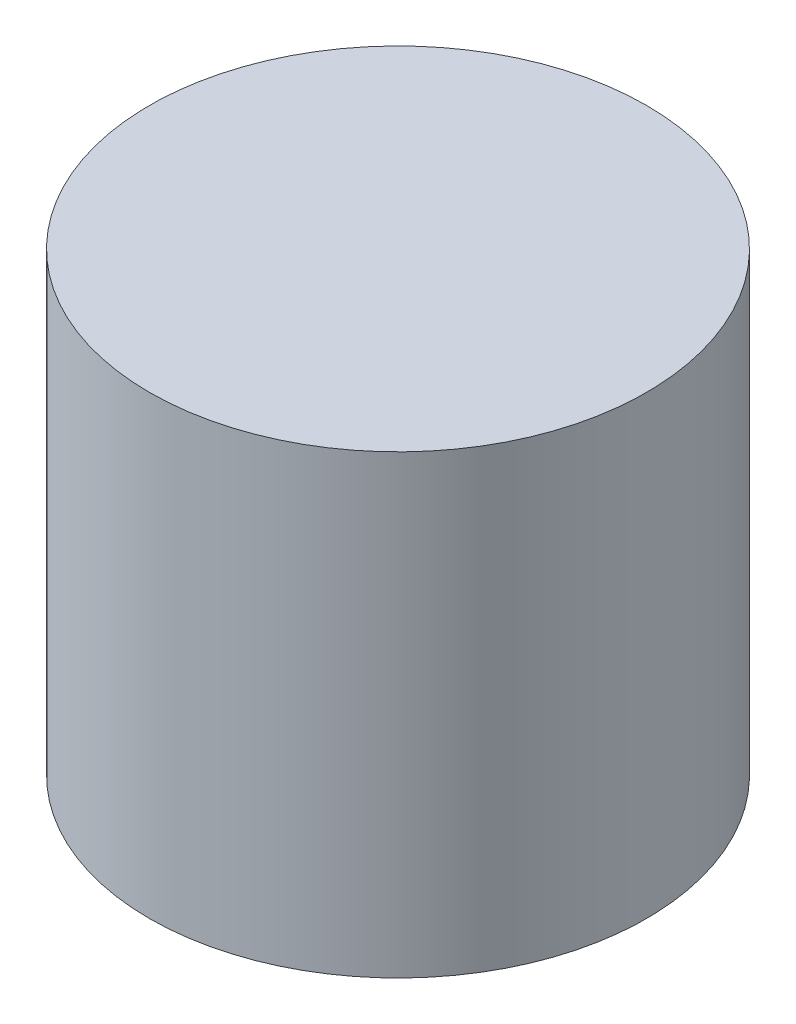
ISO-10303-21;
HEADER;
FILE_DESCRIPTION(('STEP AP214'),'2;1');
FILE_NAME('part.step','',(''),(''),'','','');
FILE_SCHEMA(('AUTOMOTIVE_DESIGN { 1 0 10303 214 1 1 1 1 }'));
ENDSEC;
DATA;
#1=APPLICATION_CONTEXT('core data for automotive mechanical design processes');
#2=APPLICATION_PROTOCOL_DEFINITION('international standard','automotive_design',2000,#1);
#3=PRODUCT_CONTEXT('',#1,'mechanical');
#4=PRODUCT('Part','Part','',(#3));
#5=PRODUCT_RELATED_PRODUCT_CATEGORY('part','',(#4));
#6=PRODUCT_DEFINITION_FORMATION('','',#4);
#7=PRODUCT_DEFINITION_CONTEXT('part definition',#1,'design');
#8=PRODUCT_DEFINITION('design','',#6,#7);
#9=PRODUCT_DEFINITION_SHAPE('','',#8);
#10=(LENGTH_UNIT() NAMED_UNIT(*) SI_UNIT(.MILLI.,.METRE.));
#11=(NAMED_UNIT(*) PLANE_ANGLE_UNIT() SI_UNIT($,.RADIAN.));
#12=(NAMED_UNIT(*) SI_UNIT($,.STERADIAN.) SOLID_ANGLE_UNIT());
#13=UNCERTAINTY_MEASURE_WITH_UNIT(LENGTH_MEASURE(1.E-05),#10,'distance_accuracy_value','');
#14=(GEOMETRIC_REPRESENTATION_CONTEXT(3) GLOBAL_UNCERTAINTY_ASSIGNED_CONTEXT((#13)) GLOBAL_UNIT_ASSIGNED_CONTEXT((#10,
#11,#12)) REPRESENTATION_CONTEXT('',''));
#15=CARTESIAN_POINT('',(0.,0.,0.));
#16=DIRECTION('',(0.,0.,1.));
#17=DIRECTION('',(1.,0.,0.));
#18=AXIS2_PLACEMENT_3D('',#15,#16,#17);
#19=CARTESIAN_POINT('',(0.,11.,0.));
#20=DIRECTION('',(0.,-1.,0.));
#21=DIRECTION('',(0.,0.,-1.));
#22=AXIS2_PLACEMENT_3D('',#19,#20,#21);
#23=CYLINDRICAL_SURFACE('',#22,6.);
#24=CARTESIAN_POINT('',(0.,11.,0.));
#25=DIRECTION('',(0.,1.,0.));
#26=DIRECTION('',(0.,0.,1.));
#27=AXIS2_PLACEMENT_3D('',#24,#25,#26);
#28=CIRCLE('',#27,6.);
#29=CARTESIAN_POINT('',(0.,11.,6.));
#30=VERTEX_POINT('',#29);
#31=EDGE_CURVE('E10',#30,#30,#28,.T.);
#32=ORIENTED_EDGE('',*,*,#31,.F.);
#33=EDGE_LOOP('',(#32));
#34=FACE_BOUND('',#33,.T.);
#35=CARTESIAN_POINT('',(0.,0.,0.));
#36=DIRECTION('',(0.,1.,0.));
#37=DIRECTION('',(0.,0.,1.));
#38=AXIS2_PLACEMENT_3D('',#35,#36,#37);
#39=CIRCLE('',#38,6.);
#40=CARTESIAN_POINT('',(0.,0.,6.));
#41=VERTEX_POINT('',#40);
#42=EDGE_CURVE('E42',#41,#41,#39,.T.);
#43=ORIENTED_EDGE('',*,*,#42,.T.);
#44=EDGE_LOOP('',(#43));
#45=FACE_BOUND('',#44,.T.);
#46=ADVANCED_FACE('F39',(#34,#45),#23,.T.);
#47=CARTESIAN_POINT('',(0.,11.,0.));
#48=DIRECTION('',(0.,1.,0.));
#49=DIRECTION('',(0.,0.,1.));
#50=AXIS2_PLACEMENT_3D('',#47,#48,#49);
#51=PLANE('',#50);
#52=ORIENTED_EDGE('',*,*,#31,.T.);
#53=EDGE_LOOP('',(#52));
#54=FACE_BOUND('',#53,.T.);
#55=ADVANCED_FACE('F54',(#54),#51,.T.);
#56=CARTESIAN_POINT('',(0.,0.,0.));
#57=DIRECTION('',(0.,1.,0.));
#58=DIRECTION('',(0.,0.,1.));
#59=AXIS2_PLACEMENT_3D('',#56,#57,#58);
#60=PLANE('',#59);
#61=ORIENTED_EDGE('',*,*,#42,.F.);
#62=EDGE_LOOP('',(#61));
#63=FACE_BOUND('',#62,.T.);
#64=ADVANCED_FACE('F52',(#63),#60,.F.);
#65=CLOSED_SHELL('',(#46,#55,#64));
#66=MANIFOLD_SOLID_BREP('B2',#65);
#67=ADVANCED_BREP_SHAPE_REPRESENTATION('',(#18,#66),#14);
#68=SHAPE_DEFINITION_REPRESENTATION(#9,#67);
ENDSEC;
END-ISO-10303-21;
